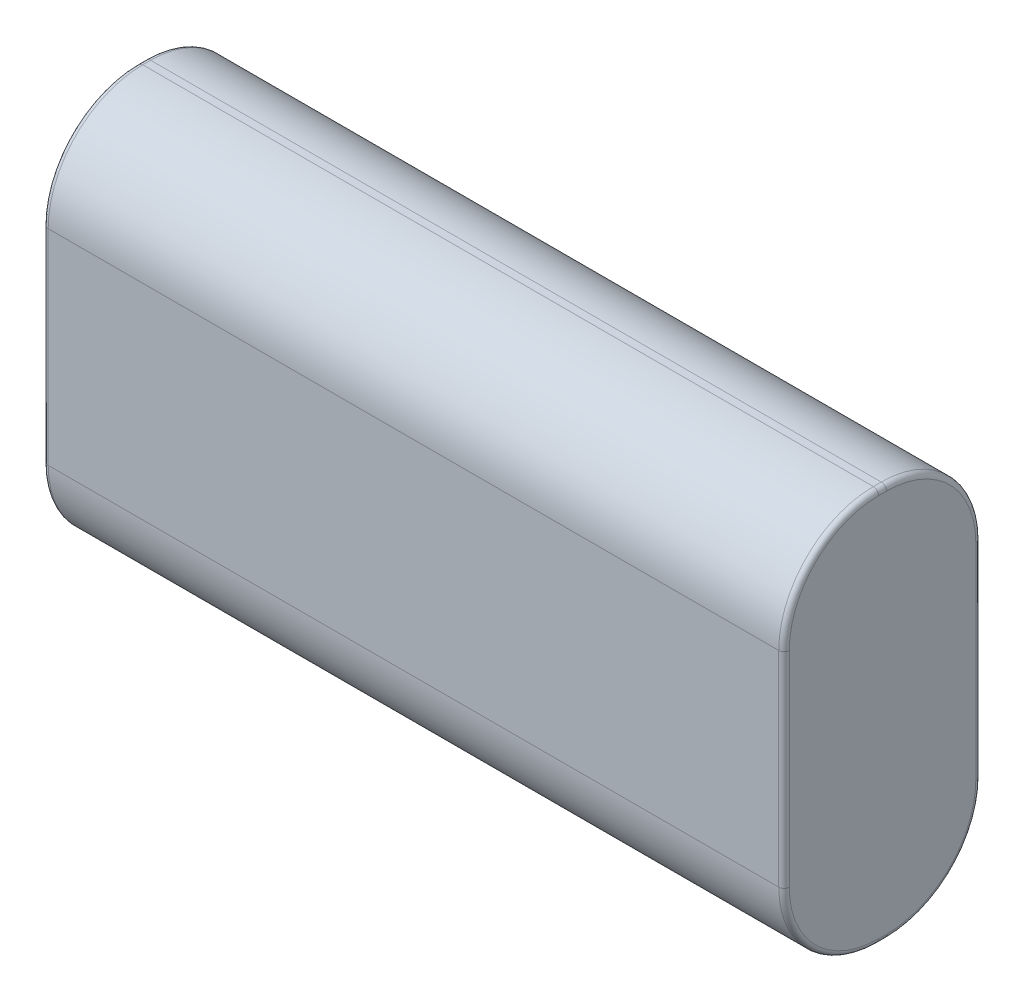
ISO-10303-21;
HEADER;
FILE_DESCRIPTION(('STEP AP214'),'2;1');
FILE_NAME('part.step','',(''),(''),'','','');
FILE_SCHEMA(('AUTOMOTIVE_DESIGN { 1 0 10303 214 1 1 1 1 }'));
ENDSEC;
DATA;
#1=APPLICATION_CONTEXT('core data for automotive mechanical design processes');
#2=APPLICATION_PROTOCOL_DEFINITION('international standard','automotive_design',2000,#1);
#3=PRODUCT_CONTEXT('',#1,'mechanical');
#4=PRODUCT('Part','Part','',(#3));
#5=PRODUCT_RELATED_PRODUCT_CATEGORY('part','',(#4));
#6=PRODUCT_DEFINITION_FORMATION('','',#4);
#7=PRODUCT_DEFINITION_CONTEXT('part definition',#1,'design');
#8=PRODUCT_DEFINITION('design','',#6,#7);
#9=PRODUCT_DEFINITION_SHAPE('','',#8);
#10=(LENGTH_UNIT() NAMED_UNIT(*) SI_UNIT(.MILLI.,.METRE.));
#11=(NAMED_UNIT(*) PLANE_ANGLE_UNIT() SI_UNIT($,.RADIAN.));
#12=(NAMED_UNIT(*) SI_UNIT($,.STERADIAN.) SOLID_ANGLE_UNIT());
#13=UNCERTAINTY_MEASURE_WITH_UNIT(LENGTH_MEASURE(1.E-05),#10,'distance_accuracy_value','');
#14=(GEOMETRIC_REPRESENTATION_CONTEXT(3) GLOBAL_UNCERTAINTY_ASSIGNED_CONTEXT((#13)) GLOBAL_UNIT_ASSIGNED_CONTEXT((#10,
#11,#12)) REPRESENTATION_CONTEXT('',''));
#15=CARTESIAN_POINT('',(0.,0.,0.));
#16=DIRECTION('',(0.,0.,1.));
#17=DIRECTION('',(1.,0.,0.));
#18=AXIS2_PLACEMENT_3D('',#15,#16,#17);
#19=CARTESIAN_POINT('',(70.5,37.5,0.));
#20=DIRECTION('',(0.,0.,-1.));
#21=DIRECTION('',(-1.,0.,0.));
#22=AXIS2_PLACEMENT_3D('',#19,#20,#21);
#23=PLANE('',#22);
#24=DIRECTION('',(-1.,0.,0.));
#25=VECTOR('',#24,1.);
#26=CARTESIAN_POINT('',(70.5,28.5,0.));
#27=LINE('',#26,#25);
#28=CARTESIAN_POINT('',(70.,28.5,0.));
#29=VERTEX_POINT('',#28);
#30=CARTESIAN_POINT('',(0.5,28.5,0.));
#31=VERTEX_POINT('',#30);
#32=EDGE_CURVE('E353',#29,#31,#27,.T.);
#33=ORIENTED_EDGE('',*,*,#32,.T.);
#34=DIRECTION('',(0.,-1.,0.));
#35=VECTOR('',#34,1.);
#36=CARTESIAN_POINT('',(0.5,37.5,0.));
#37=LINE('',#36,#35);
#38=CARTESIAN_POINT('',(0.5,9.,0.));
#39=VERTEX_POINT('',#38);
#40=EDGE_CURVE('E218',#31,#39,#37,.T.);
#41=ORIENTED_EDGE('',*,*,#40,.T.);
#42=DIRECTION('',(-1.,0.,0.));
#43=VECTOR('',#42,1.);
#44=CARTESIAN_POINT('',(70.5,9.,0.));
#45=LINE('',#44,#43);
#46=CARTESIAN_POINT('',(70.,9.,0.));
#47=VERTEX_POINT('',#46);
#48=EDGE_CURVE('E357',#39,#47,#45,.F.);
#49=ORIENTED_EDGE('',*,*,#48,.T.);
#50=DIRECTION('',(0.,-1.,0.));
#51=VECTOR('',#50,1.);
#52=CARTESIAN_POINT('',(70.,28.5,0.));
#53=LINE('',#52,#51);
#54=EDGE_CURVE('E215',#47,#29,#53,.F.);
#55=ORIENTED_EDGE('',*,*,#54,.T.);
#56=EDGE_LOOP('',(#33,#41,#49,#55));
#57=FACE_BOUND('',#56,.T.);
#58=ADVANCED_FACE('F49',(#57),#23,.F.);
#59=CARTESIAN_POINT('',(70.5,0.,0.));
#60=DIRECTION('',(0.,1.,0.));
#61=DIRECTION('',(0.,0.,1.));
#62=AXIS2_PLACEMENT_3D('',#59,#60,#61);
#63=PLANE('',#62);
#64=DIRECTION('',(-1.,0.,0.));
#65=VECTOR('',#64,1.);
#66=CARTESIAN_POINT('',(70.5,0.,-9.));
#67=LINE('',#66,#65);
#68=CARTESIAN_POINT('',(70.,0.,-9.));
#69=VERTEX_POINT('',#68);
#70=CARTESIAN_POINT('',(0.5,0.,-9.));
#71=VERTEX_POINT('',#70);
#72=EDGE_CURVE('E343',#69,#71,#67,.T.);
#73=ORIENTED_EDGE('',*,*,#72,.T.);
#74=DIRECTION('',(0.,0.,-1.));
#75=VECTOR('',#74,1.);
#76=CARTESIAN_POINT('',(0.5,0.,0.));
#77=LINE('',#76,#75);
#78=CARTESIAN_POINT('',(0.5,0.,-9.75));
#79=VERTEX_POINT('',#78);
#80=EDGE_CURVE('E231',#71,#79,#77,.T.);
#81=ORIENTED_EDGE('',*,*,#80,.T.);
#82=DIRECTION('',(-1.,0.,0.));
#83=VECTOR('',#82,1.);
#84=CARTESIAN_POINT('',(70.5,0.,-9.75));
#85=LINE('',#84,#83);
#86=CARTESIAN_POINT('',(70.,0.,-9.75));
#87=VERTEX_POINT('',#86);
#88=EDGE_CURVE('E349',#79,#87,#85,.F.);
#89=ORIENTED_EDGE('',*,*,#88,.T.);
#90=DIRECTION('',(0.,0.,-1.));
#91=VECTOR('',#90,1.);
#92=CARTESIAN_POINT('',(70.,0.,-9.));
#93=LINE('',#92,#91);
#94=EDGE_CURVE('E228',#87,#69,#93,.F.);
#95=ORIENTED_EDGE('',*,*,#94,.T.);
#96=EDGE_LOOP('',(#73,#81,#89,#95));
#97=FACE_BOUND('',#96,.T.);
#98=ADVANCED_FACE('F418',(#97),#63,.F.);
#99=CARTESIAN_POINT('',(70.5,0.,-18.75));
#100=DIRECTION('',(0.,0.,1.));
#101=DIRECTION('',(1.,0.,0.));
#102=AXIS2_PLACEMENT_3D('',#99,#100,#101);
#103=PLANE('',#102);
#104=DIRECTION('',(-1.,0.,0.));
#105=VECTOR('',#104,1.);
#106=CARTESIAN_POINT('',(70.5,9.,-18.75));
#107=LINE('',#106,#105);
#108=CARTESIAN_POINT('',(70.,9.,-18.75));
#109=VERTEX_POINT('',#108);
#110=CARTESIAN_POINT('',(0.5,9.,-18.75));
#111=VERTEX_POINT('',#110);
#112=EDGE_CURVE('E340',#109,#111,#107,.T.);
#113=ORIENTED_EDGE('',*,*,#112,.T.);
#114=DIRECTION('',(0.,1.,0.));
#115=VECTOR('',#114,1.);
#116=CARTESIAN_POINT('',(0.5,0.,-18.75));
#117=LINE('',#116,#115);
#118=CARTESIAN_POINT('',(0.5,28.5,-18.75));
#119=VERTEX_POINT('',#118);
#120=EDGE_CURVE('E243',#111,#119,#117,.T.);
#121=ORIENTED_EDGE('',*,*,#120,.T.);
#122=DIRECTION('',(-1.,0.,0.));
#123=VECTOR('',#122,1.);
#124=CARTESIAN_POINT('',(70.5,28.5,-18.75));
#125=LINE('',#124,#123);
#126=CARTESIAN_POINT('',(70.,28.5,-18.75));
#127=VERTEX_POINT('',#126);
#128=EDGE_CURVE('E289',#119,#127,#125,.F.);
#129=ORIENTED_EDGE('',*,*,#128,.T.);
#130=DIRECTION('',(0.,1.,0.));
#131=VECTOR('',#130,1.);
#132=CARTESIAN_POINT('',(70.,9.,-18.75));
#133=LINE('',#132,#131);
#134=EDGE_CURVE('E240',#127,#109,#133,.F.);
#135=ORIENTED_EDGE('',*,*,#134,.T.);
#136=EDGE_LOOP('',(#113,#121,#129,#135));
#137=FACE_BOUND('',#136,.T.);
#138=ADVANCED_FACE('F337',(#137),#103,.F.);
#139=CARTESIAN_POINT('',(70.5,37.5,-18.75));
#140=DIRECTION('',(0.,-1.,0.));
#141=DIRECTION('',(0.,0.,-1.));
#142=AXIS2_PLACEMENT_3D('',#139,#140,#141);
#143=PLANE('',#142);
#144=DIRECTION('',(-1.,0.,0.));
#145=VECTOR('',#144,1.);
#146=CARTESIAN_POINT('',(70.5,37.5,-9.75));
#147=LINE('',#146,#145);
#148=CARTESIAN_POINT('',(70.,37.5,-9.75));
#149=VERTEX_POINT('',#148);
#150=CARTESIAN_POINT('',(0.5,37.5,-9.75));
#151=VERTEX_POINT('',#150);
#152=EDGE_CURVE('E185',#149,#151,#147,.T.);
#153=ORIENTED_EDGE('',*,*,#152,.T.);
#154=DIRECTION('',(0.,0.,1.));
#155=VECTOR('',#154,1.);
#156=CARTESIAN_POINT('',(0.5,37.5,-18.75));
#157=LINE('',#156,#155);
#158=CARTESIAN_POINT('',(0.5,37.5,-9.));
#159=VERTEX_POINT('',#158);
#160=EDGE_CURVE('E206',#151,#159,#157,.T.);
#161=ORIENTED_EDGE('',*,*,#160,.T.);
#162=DIRECTION('',(-1.,0.,0.));
#163=VECTOR('',#162,1.);
#164=CARTESIAN_POINT('',(70.5,37.5,-9.));
#165=LINE('',#164,#163);
#166=CARTESIAN_POINT('',(70.,37.5,-9.));
#167=VERTEX_POINT('',#166);
#168=EDGE_CURVE('E361',#159,#167,#165,.F.);
#169=ORIENTED_EDGE('',*,*,#168,.T.);
#170=DIRECTION('',(0.,0.,1.));
#171=VECTOR('',#170,1.);
#172=CARTESIAN_POINT('',(70.,37.5,-9.75));
#173=LINE('',#172,#171);
#174=EDGE_CURVE('E203',#167,#149,#173,.F.);
#175=ORIENTED_EDGE('',*,*,#174,.T.);
#176=EDGE_LOOP('',(#153,#161,#169,#175));
#177=FACE_BOUND('',#176,.T.);
#178=ADVANCED_FACE('F390',(#177),#143,.F.);
#179=CARTESIAN_POINT('',(70.5,0.,0.));
#180=DIRECTION('',(1.,0.,0.));
#181=DIRECTION('',(0.,0.,-1.));
#182=AXIS2_PLACEMENT_3D('',#179,#180,#181);
#183=PLANE('',#182);
#184=DIRECTION('',(0.,-1.,0.));
#185=VECTOR('',#184,1.);
#186=CARTESIAN_POINT('',(70.5,9.,-0.5));
#187=LINE('',#186,#185);
#188=CARTESIAN_POINT('',(70.5,28.5,-0.5));
#189=VERTEX_POINT('',#188);
#190=CARTESIAN_POINT('',(70.5,9.,-0.5));
#191=VERTEX_POINT('',#190);
#192=EDGE_CURVE('E59',#189,#191,#187,.T.);
#193=ORIENTED_EDGE('',*,*,#192,.T.);
#194=CARTESIAN_POINT('',(70.5,9.,-9.));
#195=DIRECTION('',(1.,0.,0.));
#196=DIRECTION('',(0.,0.,-1.));
#197=AXIS2_PLACEMENT_3D('',#194,#195,#196);
#198=CIRCLE('',#197,8.5);
#199=CARTESIAN_POINT('',(70.5,0.5,-9.));
#200=VERTEX_POINT('',#199);
#201=EDGE_CURVE('E11',#191,#200,#198,.T.);
#202=ORIENTED_EDGE('',*,*,#201,.T.);
#203=DIRECTION('',(0.,0.,-1.));
#204=VECTOR('',#203,1.);
#205=CARTESIAN_POINT('',(70.5,0.5,-9.75));
#206=LINE('',#205,#204);
#207=CARTESIAN_POINT('',(70.5,0.5,-9.75));
#208=VERTEX_POINT('',#207);
#209=EDGE_CURVE('E246',#200,#208,#206,.T.);
#210=ORIENTED_EDGE('',*,*,#209,.T.);
#211=CARTESIAN_POINT('',(70.5,9.,-9.75));
#212=DIRECTION('',(1.,0.,0.));
#213=DIRECTION('',(0.,0.,-1.));
#214=AXIS2_PLACEMENT_3D('',#211,#212,#213);
#215=CIRCLE('',#214,8.5);
#216=CARTESIAN_POINT('',(70.5,9.,-18.25));
#217=VERTEX_POINT('',#216);
#218=EDGE_CURVE('E249',#208,#217,#215,.T.);
#219=ORIENTED_EDGE('',*,*,#218,.T.);
#220=DIRECTION('',(0.,1.,0.));
#221=VECTOR('',#220,1.);
#222=CARTESIAN_POINT('',(70.5,28.5,-18.25));
#223=LINE('',#222,#221);
#224=CARTESIAN_POINT('',(70.5,28.5,-18.25));
#225=VERTEX_POINT('',#224);
#226=EDGE_CURVE('E252',#217,#225,#223,.T.);
#227=ORIENTED_EDGE('',*,*,#226,.T.);
#228=CARTESIAN_POINT('',(70.5,28.5,-9.75));
#229=DIRECTION('',(1.,0.,0.));
#230=DIRECTION('',(0.,0.,-1.));
#231=AXIS2_PLACEMENT_3D('',#228,#229,#230);
#232=CIRCLE('',#231,8.5);
#233=CARTESIAN_POINT('',(70.5,37.,-9.75));
#234=VERTEX_POINT('',#233);
#235=EDGE_CURVE('E255',#225,#234,#232,.T.);
#236=ORIENTED_EDGE('',*,*,#235,.T.);
#237=DIRECTION('',(0.,0.,1.));
#238=VECTOR('',#237,1.);
#239=CARTESIAN_POINT('',(70.5,37.,-9.));
#240=LINE('',#239,#238);
#241=CARTESIAN_POINT('',(70.5,37.,-9.));
#242=VERTEX_POINT('',#241);
#243=EDGE_CURVE('E258',#234,#242,#240,.T.);
#244=ORIENTED_EDGE('',*,*,#243,.T.);
#245=CARTESIAN_POINT('',(70.5,28.5,-9.));
#246=DIRECTION('',(1.,0.,0.));
#247=DIRECTION('',(0.,0.,-1.));
#248=AXIS2_PLACEMENT_3D('',#245,#246,#247);
#249=CIRCLE('',#248,8.5);
#250=EDGE_CURVE('E70',#242,#189,#249,.T.);
#251=ORIENTED_EDGE('',*,*,#250,.T.);
#252=EDGE_LOOP('',(#193,#202,#210,#219,#227,#236,#244,#251));
#253=FACE_BOUND('',#252,.T.);
#254=ADVANCED_FACE('F406',(#253),#183,.T.);
#255=CARTESIAN_POINT('',(0.,0.,0.));
#256=DIRECTION('',(1.,0.,0.));
#257=DIRECTION('',(0.,0.,-1.));
#258=AXIS2_PLACEMENT_3D('',#255,#256,#257);
#259=PLANE('',#258);
#260=DIRECTION('',(0.,0.,1.));
#261=VECTOR('',#260,1.);
#262=CARTESIAN_POINT('',(0.,37.,0.));
#263=LINE('',#262,#261);
#264=CARTESIAN_POINT('',(0.,37.,-9.));
#265=VERTEX_POINT('',#264);
#266=CARTESIAN_POINT('',(0.,37.,-9.75));
#267=VERTEX_POINT('',#266);
#268=EDGE_CURVE('E189',#265,#267,#263,.F.);
#269=ORIENTED_EDGE('',*,*,#268,.T.);
#270=CARTESIAN_POINT('',(0.,28.5,-9.75));
#271=DIRECTION('',(1.,0.,0.));
#272=DIRECTION('',(0.,0.,-1.));
#273=AXIS2_PLACEMENT_3D('',#270,#271,#272);
#274=CIRCLE('',#273,8.5);
#275=CARTESIAN_POINT('',(0.,28.5,-18.25));
#276=VERTEX_POINT('',#275);
#277=EDGE_CURVE('E168',#267,#276,#274,.F.);
#278=ORIENTED_EDGE('',*,*,#277,.T.);
#279=DIRECTION('',(0.,1.,0.));
#280=VECTOR('',#279,1.);
#281=CARTESIAN_POINT('',(0.,0.,-18.25));
#282=LINE('',#281,#280);
#283=CARTESIAN_POINT('',(0.,9.,-18.25));
#284=VERTEX_POINT('',#283);
#285=EDGE_CURVE('E177',#276,#284,#282,.F.);
#286=ORIENTED_EDGE('',*,*,#285,.T.);
#287=CARTESIAN_POINT('',(0.,9.,-9.75));
#288=DIRECTION('',(1.,0.,0.));
#289=DIRECTION('',(0.,0.,-1.));
#290=AXIS2_PLACEMENT_3D('',#287,#288,#289);
#291=CIRCLE('',#290,8.5);
#292=CARTESIAN_POINT('',(0.,0.5,-9.75));
#293=VERTEX_POINT('',#292);
#294=EDGE_CURVE('E184',#284,#293,#291,.F.);
#295=ORIENTED_EDGE('',*,*,#294,.T.);
#296=DIRECTION('',(0.,0.,-1.));
#297=VECTOR('',#296,1.);
#298=CARTESIAN_POINT('',(0.,0.5,0.));
#299=LINE('',#298,#297);
#300=CARTESIAN_POINT('',(0.,0.5,-9.));
#301=VERTEX_POINT('',#300);
#302=EDGE_CURVE('E369',#293,#301,#299,.F.);
#303=ORIENTED_EDGE('',*,*,#302,.T.);
#304=CARTESIAN_POINT('',(0.,9.,-9.));
#305=DIRECTION('',(1.,0.,0.));
#306=DIRECTION('',(0.,0.,-1.));
#307=AXIS2_PLACEMENT_3D('',#304,#305,#306);
#308=CIRCLE('',#307,8.5);
#309=CARTESIAN_POINT('',(0.,9.,-0.5));
#310=VERTEX_POINT('',#309);
#311=EDGE_CURVE('E372',#301,#310,#308,.F.);
#312=ORIENTED_EDGE('',*,*,#311,.T.);
#313=DIRECTION('',(0.,-1.,0.));
#314=VECTOR('',#313,1.);
#315=CARTESIAN_POINT('',(0.,0.,-0.5));
#316=LINE('',#315,#314);
#317=CARTESIAN_POINT('',(0.,28.5,-0.5));
#318=VERTEX_POINT('',#317);
#319=EDGE_CURVE('E375',#310,#318,#316,.F.);
#320=ORIENTED_EDGE('',*,*,#319,.T.);
#321=CARTESIAN_POINT('',(0.,28.5,-9.));
#322=DIRECTION('',(1.,0.,0.));
#323=DIRECTION('',(0.,0.,-1.));
#324=AXIS2_PLACEMENT_3D('',#321,#322,#323);
#325=CIRCLE('',#324,8.5);
#326=EDGE_CURVE('E197',#318,#265,#325,.F.);
#327=ORIENTED_EDGE('',*,*,#326,.T.);
#328=EDGE_LOOP('',(#269,#278,#286,#295,#303,#312,#320,#327));
#329=FACE_BOUND('',#328,.T.);
#330=ADVANCED_FACE('F187',(#329),#259,.F.);
#331=CARTESIAN_POINT('',(70.5,9.,-9.75));
#332=DIRECTION('',(-1.,0.,0.));
#333=DIRECTION('',(0.,0.,1.));
#334=AXIS2_PLACEMENT_3D('',#331,#332,#333);
#335=CYLINDRICAL_SURFACE('',#334,9.);
#336=ORIENTED_EDGE('',*,*,#88,.F.);
#337=CARTESIAN_POINT('',(0.5,9.,-9.75));
#338=DIRECTION('',(1.,0.,0.));
#339=DIRECTION('',(0.,0.,-1.));
#340=AXIS2_PLACEMENT_3D('',#337,#338,#339);
#341=CIRCLE('',#340,9.);
#342=EDGE_CURVE('E237',#79,#111,#341,.T.);
#343=ORIENTED_EDGE('',*,*,#342,.T.);
#344=ORIENTED_EDGE('',*,*,#112,.F.);
#345=CARTESIAN_POINT('',(70.,9.,-9.75));
#346=DIRECTION('',(1.,0.,0.));
#347=DIRECTION('',(0.,0.,-1.));
#348=AXIS2_PLACEMENT_3D('',#345,#346,#347);
#349=CIRCLE('',#348,9.);
#350=EDGE_CURVE('E234',#109,#87,#349,.F.);
#351=ORIENTED_EDGE('',*,*,#350,.T.);
#352=EDGE_LOOP('',(#336,#343,#344,#351));
#353=FACE_BOUND('',#352,.T.);
#354=ADVANCED_FACE('F442',(#353),#335,.T.);
#355=CARTESIAN_POINT('',(70.5,9.,-9.));
#356=DIRECTION('',(-1.,0.,0.));
#357=DIRECTION('',(0.,0.,1.));
#358=AXIS2_PLACEMENT_3D('',#355,#356,#357);
#359=CYLINDRICAL_SURFACE('',#358,9.);
#360=ORIENTED_EDGE('',*,*,#48,.F.);
#361=CARTESIAN_POINT('',(0.5,9.,-9.));
#362=DIRECTION('',(1.,0.,0.));
#363=DIRECTION('',(0.,0.,-1.));
#364=AXIS2_PLACEMENT_3D('',#361,#362,#363);
#365=CIRCLE('',#364,9.);
#366=EDGE_CURVE('E225',#39,#71,#365,.T.);
#367=ORIENTED_EDGE('',*,*,#366,.T.);
#368=ORIENTED_EDGE('',*,*,#72,.F.);
#369=CARTESIAN_POINT('',(70.,9.,-9.));
#370=DIRECTION('',(1.,0.,0.));
#371=DIRECTION('',(0.,0.,-1.));
#372=AXIS2_PLACEMENT_3D('',#369,#370,#371);
#373=CIRCLE('',#372,9.);
#374=EDGE_CURVE('E221',#69,#47,#373,.F.);
#375=ORIENTED_EDGE('',*,*,#374,.T.);
#376=EDGE_LOOP('',(#360,#367,#368,#375));
#377=FACE_BOUND('',#376,.T.);
#378=ADVANCED_FACE('F423',(#377),#359,.T.);
#379=CARTESIAN_POINT('',(70.5,28.5,-9.75));
#380=DIRECTION('',(-1.,0.,0.));
#381=DIRECTION('',(0.,0.,1.));
#382=AXIS2_PLACEMENT_3D('',#379,#380,#381);
#383=CYLINDRICAL_SURFACE('',#382,9.);
#384=ORIENTED_EDGE('',*,*,#128,.F.);
#385=CARTESIAN_POINT('',(0.5,28.5,-9.75));
#386=DIRECTION('',(1.,0.,0.));
#387=DIRECTION('',(0.,0.,-1.));
#388=AXIS2_PLACEMENT_3D('',#385,#386,#387);
#389=CIRCLE('',#388,9.);
#390=EDGE_CURVE('E170',#119,#151,#389,.T.);
#391=ORIENTED_EDGE('',*,*,#390,.T.);
#392=ORIENTED_EDGE('',*,*,#152,.F.);
#393=CARTESIAN_POINT('',(70.,28.5,-9.75));
#394=DIRECTION('',(1.,0.,0.));
#395=DIRECTION('',(0.,0.,-1.));
#396=AXIS2_PLACEMENT_3D('',#393,#394,#395);
#397=CIRCLE('',#396,9.);
#398=EDGE_CURVE('E192',#149,#127,#397,.F.);
#399=ORIENTED_EDGE('',*,*,#398,.T.);
#400=EDGE_LOOP('',(#384,#391,#392,#399));
#401=FACE_BOUND('',#400,.T.);
#402=ADVANCED_FACE('F333',(#401),#383,.T.);
#403=CARTESIAN_POINT('',(70.5,28.5,-9.));
#404=DIRECTION('',(-1.,0.,0.));
#405=DIRECTION('',(0.,0.,1.));
#406=AXIS2_PLACEMENT_3D('',#403,#404,#405);
#407=CYLINDRICAL_SURFACE('',#406,9.);
#408=ORIENTED_EDGE('',*,*,#168,.F.);
#409=CARTESIAN_POINT('',(0.5,28.5,-9.));
#410=DIRECTION('',(1.,0.,0.));
#411=DIRECTION('',(0.,0.,-1.));
#412=AXIS2_PLACEMENT_3D('',#409,#410,#411);
#413=CIRCLE('',#412,9.);
#414=EDGE_CURVE('E212',#159,#31,#413,.T.);
#415=ORIENTED_EDGE('',*,*,#414,.T.);
#416=ORIENTED_EDGE('',*,*,#32,.F.);
#417=CARTESIAN_POINT('',(70.,28.5,-9.));
#418=DIRECTION('',(1.,0.,0.));
#419=DIRECTION('',(0.,0.,-1.));
#420=AXIS2_PLACEMENT_3D('',#417,#418,#419);
#421=CIRCLE('',#420,9.);
#422=EDGE_CURVE('E209',#29,#167,#421,.F.);
#423=ORIENTED_EDGE('',*,*,#422,.T.);
#424=EDGE_LOOP('',(#408,#415,#416,#423));
#425=FACE_BOUND('',#424,.T.);
#426=ADVANCED_FACE('F392',(#425),#407,.T.);
#427=CARTESIAN_POINT('',(0.5,9.,-9.));
#428=DIRECTION('',(1.,0.,0.));
#429=DIRECTION('',(0.,0.,-1.));
#430=AXIS2_PLACEMENT_3D('',#427,#428,#429);
#431=TOROIDAL_SURFACE('',#430,8.5,0.5);
#432=CARTESIAN_POINT('',(0.5,0.5,-9.));
#433=DIRECTION('',(0.,0.,-1.));
#434=DIRECTION('',(-1.,0.,0.));
#435=AXIS2_PLACEMENT_3D('',#432,#433,#434);
#436=CIRCLE('',#435,0.5);
#437=EDGE_CURVE('E281',#71,#301,#436,.T.);
#438=ORIENTED_EDGE('',*,*,#437,.F.);
#439=ORIENTED_EDGE('',*,*,#366,.F.);
#440=CARTESIAN_POINT('',(0.5,9.,-0.5));
#441=DIRECTION('',(0.,1.,0.));
#442=DIRECTION('',(0.,0.,1.));
#443=AXIS2_PLACEMENT_3D('',#440,#441,#442);
#444=CIRCLE('',#443,0.5);
#445=EDGE_CURVE('E285',#310,#39,#444,.T.);
#446=ORIENTED_EDGE('',*,*,#445,.F.);
#447=ORIENTED_EDGE('',*,*,#311,.F.);
#448=EDGE_LOOP('',(#438,#439,#446,#447));
#449=FACE_BOUND('',#448,.T.);
#450=ADVANCED_FACE('F427',(#449),#431,.T.);
#451=CARTESIAN_POINT('',(0.5,37.5,-0.5));
#452=DIRECTION('',(0.,-1.,0.));
#453=DIRECTION('',(0.,0.,-1.));
#454=AXIS2_PLACEMENT_3D('',#451,#452,#453);
#455=CYLINDRICAL_SURFACE('',#454,0.5);
#456=ORIENTED_EDGE('',*,*,#445,.T.);
#457=ORIENTED_EDGE('',*,*,#40,.F.);
#458=CARTESIAN_POINT('',(0.5,28.5,-0.5));
#459=DIRECTION('',(0.,1.,0.));
#460=DIRECTION('',(0.,0.,1.));
#461=AXIS2_PLACEMENT_3D('',#458,#459,#460);
#462=CIRCLE('',#461,0.5);
#463=EDGE_CURVE('E277',#318,#31,#462,.T.);
#464=ORIENTED_EDGE('',*,*,#463,.F.);
#465=ORIENTED_EDGE('',*,*,#319,.F.);
#466=EDGE_LOOP('',(#456,#457,#464,#465));
#467=FACE_BOUND('',#466,.T.);
#468=ADVANCED_FACE('F432',(#467),#455,.T.);
#469=CARTESIAN_POINT('',(0.5,0.5,0.));
#470=DIRECTION('',(0.,0.,-1.));
#471=DIRECTION('',(-1.,0.,0.));
#472=AXIS2_PLACEMENT_3D('',#469,#470,#471);
#473=CYLINDRICAL_SURFACE('',#472,0.5);
#474=ORIENTED_EDGE('',*,*,#437,.T.);
#475=ORIENTED_EDGE('',*,*,#302,.F.);
#476=CARTESIAN_POINT('',(0.5,0.5,-9.75));
#477=DIRECTION('',(0.,0.,-1.));
#478=DIRECTION('',(-1.,0.,0.));
#479=AXIS2_PLACEMENT_3D('',#476,#477,#478);
#480=CIRCLE('',#479,0.5);
#481=EDGE_CURVE('E273',#79,#293,#480,.T.);
#482=ORIENTED_EDGE('',*,*,#481,.F.);
#483=ORIENTED_EDGE('',*,*,#80,.F.);
#484=EDGE_LOOP('',(#474,#475,#482,#483));
#485=FACE_BOUND('',#484,.T.);
#486=ADVANCED_FACE('F464',(#485),#473,.T.);
#487=CARTESIAN_POINT('',(0.5,28.5,-9.));
#488=DIRECTION('',(1.,0.,0.));
#489=DIRECTION('',(0.,0.,-1.));
#490=AXIS2_PLACEMENT_3D('',#487,#488,#489);
#491=TOROIDAL_SURFACE('',#490,8.5,0.5);
#492=ORIENTED_EDGE('',*,*,#463,.T.);
#493=ORIENTED_EDGE('',*,*,#414,.F.);
#494=CARTESIAN_POINT('',(0.5,37.,-9.));
#495=DIRECTION('',(0.,0.,-1.));
#496=DIRECTION('',(-1.,0.,0.));
#497=AXIS2_PLACEMENT_3D('',#494,#495,#496);
#498=CIRCLE('',#497,0.5);
#499=EDGE_CURVE('E269',#265,#159,#498,.T.);
#500=ORIENTED_EDGE('',*,*,#499,.F.);
#501=ORIENTED_EDGE('',*,*,#326,.F.);
#502=EDGE_LOOP('',(#492,#493,#500,#501));
#503=FACE_BOUND('',#502,.T.);
#504=ADVANCED_FACE('F384',(#503),#491,.T.);
#505=CARTESIAN_POINT('',(0.5,9.,-9.75));
#506=DIRECTION('',(1.,0.,0.));
#507=DIRECTION('',(0.,0.,-1.));
#508=AXIS2_PLACEMENT_3D('',#505,#506,#507);
#509=TOROIDAL_SURFACE('',#508,8.5,0.5);
#510=ORIENTED_EDGE('',*,*,#481,.T.);
#511=ORIENTED_EDGE('',*,*,#294,.F.);
#512=CARTESIAN_POINT('',(0.5,9.,-18.25));
#513=DIRECTION('',(0.,1.,0.));
#514=DIRECTION('',(0.,0.,1.));
#515=AXIS2_PLACEMENT_3D('',#512,#513,#514);
#516=CIRCLE('',#515,0.5);
#517=EDGE_CURVE('E180',#111,#284,#516,.T.);
#518=ORIENTED_EDGE('',*,*,#517,.F.);
#519=ORIENTED_EDGE('',*,*,#342,.F.);
#520=EDGE_LOOP('',(#510,#511,#518,#519));
#521=FACE_BOUND('',#520,.T.);
#522=ADVANCED_FACE('F458',(#521),#509,.T.);
#523=CARTESIAN_POINT('',(0.5,37.,-18.75));
#524=DIRECTION('',(0.,0.,1.));
#525=DIRECTION('',(0.,-1.,0.));
#526=AXIS2_PLACEMENT_3D('',#523,#524,#525);
#527=CYLINDRICAL_SURFACE('',#526,0.5);
#528=ORIENTED_EDGE('',*,*,#499,.T.);
#529=ORIENTED_EDGE('',*,*,#160,.F.);
#530=CARTESIAN_POINT('',(0.5,37.,-9.75));
#531=DIRECTION('',(0.,0.,-1.));
#532=DIRECTION('',(-1.,0.,0.));
#533=AXIS2_PLACEMENT_3D('',#530,#531,#532);
#534=CIRCLE('',#533,0.5);
#535=EDGE_CURVE('E174',#267,#151,#534,.T.);
#536=ORIENTED_EDGE('',*,*,#535,.F.);
#537=ORIENTED_EDGE('',*,*,#268,.F.);
#538=EDGE_LOOP('',(#528,#529,#536,#537));
#539=FACE_BOUND('',#538,.T.);
#540=ADVANCED_FACE('F387',(#539),#527,.T.);
#541=CARTESIAN_POINT('',(0.5,0.,-18.25));
#542=DIRECTION('',(0.,1.,0.));
#543=DIRECTION('',(0.,0.,1.));
#544=AXIS2_PLACEMENT_3D('',#541,#542,#543);
#545=CYLINDRICAL_SURFACE('',#544,0.5);
#546=ORIENTED_EDGE('',*,*,#517,.T.);
#547=ORIENTED_EDGE('',*,*,#285,.F.);
#548=CARTESIAN_POINT('',(0.5,28.5,-18.25));
#549=DIRECTION('',(0.,1.,0.));
#550=DIRECTION('',(0.,0.,1.));
#551=AXIS2_PLACEMENT_3D('',#548,#549,#550);
#552=CIRCLE('',#551,0.5);
#553=EDGE_CURVE('E164',#119,#276,#552,.T.);
#554=ORIENTED_EDGE('',*,*,#553,.F.);
#555=ORIENTED_EDGE('',*,*,#120,.F.);
#556=EDGE_LOOP('',(#546,#547,#554,#555));
#557=FACE_BOUND('',#556,.T.);
#558=ADVANCED_FACE('F178',(#557),#545,.T.);
#559=CARTESIAN_POINT('',(0.5,28.5,-9.75));
#560=DIRECTION('',(1.,0.,0.));
#561=DIRECTION('',(0.,0.,-1.));
#562=AXIS2_PLACEMENT_3D('',#559,#560,#561);
#563=TOROIDAL_SURFACE('',#562,8.5,0.5);
#564=ORIENTED_EDGE('',*,*,#535,.T.);
#565=ORIENTED_EDGE('',*,*,#390,.F.);
#566=ORIENTED_EDGE('',*,*,#553,.T.);
#567=ORIENTED_EDGE('',*,*,#277,.F.);
#568=EDGE_LOOP('',(#564,#565,#566,#567));
#569=FACE_BOUND('',#568,.T.);
#570=ADVANCED_FACE('F166',(#569),#563,.T.);
#571=CARTESIAN_POINT('',(70.,28.5,-9.75));
#572=DIRECTION('',(1.,0.,0.));
#573=DIRECTION('',(0.,0.,-1.));
#574=AXIS2_PLACEMENT_3D('',#571,#572,#573);
#575=TOROIDAL_SURFACE('',#574,8.5,0.5);
#576=CARTESIAN_POINT('',(70.,28.5,-18.25));
#577=DIRECTION('',(0.,-1.,0.));
#578=DIRECTION('',(0.,0.,-1.));
#579=AXIS2_PLACEMENT_3D('',#576,#577,#578);
#580=CIRCLE('',#579,0.5);
#581=EDGE_CURVE('E311',#127,#225,#580,.T.);
#582=ORIENTED_EDGE('',*,*,#581,.F.);
#583=ORIENTED_EDGE('',*,*,#398,.F.);
#584=CARTESIAN_POINT('',(70.,37.,-9.75));
#585=DIRECTION('',(0.,0.,1.));
#586=DIRECTION('',(1.,0.,0.));
#587=AXIS2_PLACEMENT_3D('',#584,#585,#586);
#588=CIRCLE('',#587,0.5);
#589=EDGE_CURVE('E53',#234,#149,#588,.T.);
#590=ORIENTED_EDGE('',*,*,#589,.F.);
#591=ORIENTED_EDGE('',*,*,#235,.F.);
#592=EDGE_LOOP('',(#582,#583,#590,#591));
#593=FACE_BOUND('',#592,.T.);
#594=ADVANCED_FACE('F51',(#593),#575,.T.);
#595=CARTESIAN_POINT('',(70.,37.,0.));
#596=DIRECTION('',(0.,0.,-1.));
#597=DIRECTION('',(0.,1.,0.));
#598=AXIS2_PLACEMENT_3D('',#595,#596,#597);
#599=CYLINDRICAL_SURFACE('',#598,0.5);
#600=ORIENTED_EDGE('',*,*,#589,.T.);
#601=ORIENTED_EDGE('',*,*,#174,.F.);
#602=CARTESIAN_POINT('',(70.,37.,-9.));
#603=DIRECTION('',(0.,0.,1.));
#604=DIRECTION('',(1.,0.,0.));
#605=AXIS2_PLACEMENT_3D('',#602,#603,#604);
#606=CIRCLE('',#605,0.5);
#607=EDGE_CURVE('E308',#242,#167,#606,.T.);
#608=ORIENTED_EDGE('',*,*,#607,.F.);
#609=ORIENTED_EDGE('',*,*,#243,.F.);
#610=EDGE_LOOP('',(#600,#601,#608,#609));
#611=FACE_BOUND('',#610,.T.);
#612=ADVANCED_FACE('F324',(#611),#599,.T.);
#613=CARTESIAN_POINT('',(70.,0.,-18.25));
#614=DIRECTION('',(0.,-1.,0.));
#615=DIRECTION('',(0.,0.,-1.));
#616=AXIS2_PLACEMENT_3D('',#613,#614,#615);
#617=CYLINDRICAL_SURFACE('',#616,0.5);
#618=ORIENTED_EDGE('',*,*,#581,.T.);
#619=ORIENTED_EDGE('',*,*,#226,.F.);
#620=CARTESIAN_POINT('',(70.,9.,-18.25));
#621=DIRECTION('',(0.,-1.,0.));
#622=DIRECTION('',(0.,0.,-1.));
#623=AXIS2_PLACEMENT_3D('',#620,#621,#622);
#624=CIRCLE('',#623,0.5);
#625=EDGE_CURVE('E304',#109,#217,#624,.T.);
#626=ORIENTED_EDGE('',*,*,#625,.F.);
#627=ORIENTED_EDGE('',*,*,#134,.F.);
#628=EDGE_LOOP('',(#618,#619,#626,#627));
#629=FACE_BOUND('',#628,.T.);
#630=ADVANCED_FACE('F482',(#629),#617,.T.);
#631=CARTESIAN_POINT('',(70.,28.5,-9.));
#632=DIRECTION('',(1.,0.,0.));
#633=DIRECTION('',(0.,0.,-1.));
#634=AXIS2_PLACEMENT_3D('',#631,#632,#633);
#635=TOROIDAL_SURFACE('',#634,8.5,0.5);
#636=ORIENTED_EDGE('',*,*,#607,.T.);
#637=ORIENTED_EDGE('',*,*,#422,.F.);
#638=CARTESIAN_POINT('',(70.,28.5,-0.5));
#639=DIRECTION('',(0.,-1.,0.));
#640=DIRECTION('',(0.,0.,-1.));
#641=AXIS2_PLACEMENT_3D('',#638,#639,#640);
#642=CIRCLE('',#641,0.5);
#643=EDGE_CURVE('E300',#189,#29,#642,.T.);
#644=ORIENTED_EDGE('',*,*,#643,.F.);
#645=ORIENTED_EDGE('',*,*,#250,.F.);
#646=EDGE_LOOP('',(#636,#637,#644,#645));
#647=FACE_BOUND('',#646,.T.);
#648=ADVANCED_FACE('F396',(#647),#635,.T.);
#649=CARTESIAN_POINT('',(70.,9.,-9.75));
#650=DIRECTION('',(1.,0.,0.));
#651=DIRECTION('',(0.,0.,-1.));
#652=AXIS2_PLACEMENT_3D('',#649,#650,#651);
#653=TOROIDAL_SURFACE('',#652,8.5,0.5);
#654=ORIENTED_EDGE('',*,*,#625,.T.);
#655=ORIENTED_EDGE('',*,*,#218,.F.);
#656=CARTESIAN_POINT('',(70.,0.5,-9.75));
#657=DIRECTION('',(0.,0.,1.));
#658=DIRECTION('',(1.,0.,0.));
#659=AXIS2_PLACEMENT_3D('',#656,#657,#658);
#660=CIRCLE('',#659,0.5);
#661=EDGE_CURVE('E296',#87,#208,#660,.T.);
#662=ORIENTED_EDGE('',*,*,#661,.F.);
#663=ORIENTED_EDGE('',*,*,#350,.F.);
#664=EDGE_LOOP('',(#654,#655,#662,#663));
#665=FACE_BOUND('',#664,.T.);
#666=ADVANCED_FACE('F411',(#665),#653,.T.);
#667=CARTESIAN_POINT('',(70.,0.,-0.5));
#668=DIRECTION('',(0.,1.,0.));
#669=DIRECTION('',(0.,0.,1.));
#670=AXIS2_PLACEMENT_3D('',#667,#668,#669);
#671=CYLINDRICAL_SURFACE('',#670,0.5);
#672=ORIENTED_EDGE('',*,*,#643,.T.);
#673=ORIENTED_EDGE('',*,*,#54,.F.);
#674=CARTESIAN_POINT('',(70.,9.,-0.5));
#675=DIRECTION('',(0.,-1.,0.));
#676=DIRECTION('',(0.,0.,-1.));
#677=AXIS2_PLACEMENT_3D('',#674,#675,#676);
#678=CIRCLE('',#677,0.5);
#679=EDGE_CURVE('E293',#191,#47,#678,.T.);
#680=ORIENTED_EDGE('',*,*,#679,.F.);
#681=ORIENTED_EDGE('',*,*,#192,.F.);
#682=EDGE_LOOP('',(#672,#673,#680,#681));
#683=FACE_BOUND('',#682,.T.);
#684=ADVANCED_FACE('F399',(#683),#671,.T.);
#685=CARTESIAN_POINT('',(70.,0.5,0.));
#686=DIRECTION('',(0.,0.,1.));
#687=DIRECTION('',(1.,0.,0.));
#688=AXIS2_PLACEMENT_3D('',#685,#686,#687);
#689=CYLINDRICAL_SURFACE('',#688,0.5);
#690=ORIENTED_EDGE('',*,*,#661,.T.);
#691=ORIENTED_EDGE('',*,*,#209,.F.);
#692=CARTESIAN_POINT('',(70.,0.5,-9.));
#693=DIRECTION('',(0.,0.,1.));
#694=DIRECTION('',(1.,0.,0.));
#695=AXIS2_PLACEMENT_3D('',#692,#693,#694);
#696=CIRCLE('',#695,0.5);
#697=EDGE_CURVE('E290',#69,#200,#696,.T.);
#698=ORIENTED_EDGE('',*,*,#697,.F.);
#699=ORIENTED_EDGE('',*,*,#94,.F.);
#700=EDGE_LOOP('',(#690,#691,#698,#699));
#701=FACE_BOUND('',#700,.T.);
#702=ADVANCED_FACE('F415',(#701),#689,.T.);
#703=CARTESIAN_POINT('',(70.,9.,-9.));
#704=DIRECTION('',(1.,0.,0.));
#705=DIRECTION('',(0.,0.,-1.));
#706=AXIS2_PLACEMENT_3D('',#703,#704,#705);
#707=TOROIDAL_SURFACE('',#706,8.5,0.5);
#708=ORIENTED_EDGE('',*,*,#679,.T.);
#709=ORIENTED_EDGE('',*,*,#374,.F.);
#710=ORIENTED_EDGE('',*,*,#697,.T.);
#711=ORIENTED_EDGE('',*,*,#201,.F.);
#712=EDGE_LOOP('',(#708,#709,#710,#711));
#713=FACE_BOUND('',#712,.T.);
#714=ADVANCED_FACE('F403',(#713),#707,.T.);
#715=CLOSED_SHELL('',(#58,#98,#138,#178,#254,#330,#354,#378,#402,#426,#450,#468,#486,#504,#522,
#540,#558,#570,#594,#612,#630,#648,#666,#684,#702,#714));
#716=MANIFOLD_SOLID_BREP('B2',#715);
#717=ADVANCED_BREP_SHAPE_REPRESENTATION('',(#18,#716),#14);
#718=SHAPE_DEFINITION_REPRESENTATION(#9,#717);
ENDSEC;
END-ISO-10303-21;
